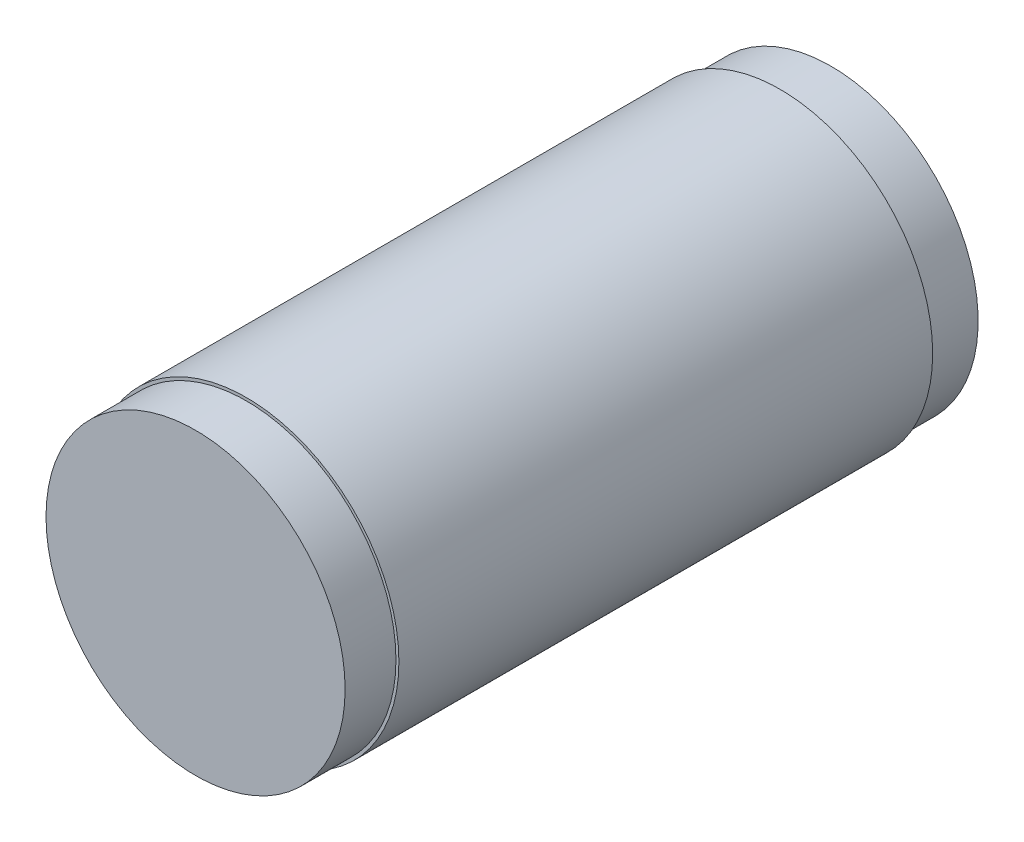
ISO-10303-21;
HEADER;
FILE_DESCRIPTION(('STEP AP214'),'2;1');
FILE_NAME('part.step','',(''),(''),'','','');
FILE_SCHEMA(('AUTOMOTIVE_DESIGN { 1 0 10303 214 1 1 1 1 }'));
ENDSEC;
DATA;
#1=APPLICATION_CONTEXT('core data for automotive mechanical design processes');
#2=APPLICATION_PROTOCOL_DEFINITION('international standard','automotive_design',2000,#1);
#3=PRODUCT_CONTEXT('',#1,'mechanical');
#4=PRODUCT('Part','Part','',(#3));
#5=PRODUCT_RELATED_PRODUCT_CATEGORY('part','',(#4));
#6=PRODUCT_DEFINITION_FORMATION('','',#4);
#7=PRODUCT_DEFINITION_CONTEXT('part definition',#1,'design');
#8=PRODUCT_DEFINITION('design','',#6,#7);
#9=PRODUCT_DEFINITION_SHAPE('','',#8);
#10=(LENGTH_UNIT() NAMED_UNIT(*) SI_UNIT(.MILLI.,.METRE.));
#11=(NAMED_UNIT(*) PLANE_ANGLE_UNIT() SI_UNIT($,.RADIAN.));
#12=(NAMED_UNIT(*) SI_UNIT($,.STERADIAN.) SOLID_ANGLE_UNIT());
#13=UNCERTAINTY_MEASURE_WITH_UNIT(LENGTH_MEASURE(1.E-05),#10,'distance_accuracy_value','');
#14=(GEOMETRIC_REPRESENTATION_CONTEXT(3) GLOBAL_UNCERTAINTY_ASSIGNED_CONTEXT((#13)) GLOBAL_UNIT_ASSIGNED_CONTEXT((#10,
#11,#12)) REPRESENTATION_CONTEXT('',''));
#15=CARTESIAN_POINT('',(0.,0.,0.));
#16=DIRECTION('',(0.,0.,1.));
#17=DIRECTION('',(1.,0.,0.));
#18=AXIS2_PLACEMENT_3D('',#15,#16,#17);
#19=CARTESIAN_POINT('',(0.,0.,125.));
#20=DIRECTION('',(0.,0.,-1.));
#21=DIRECTION('',(-1.,0.,0.));
#22=AXIS2_PLACEMENT_3D('',#19,#20,#21);
#23=CYLINDRICAL_SURFACE('',#22,30.);
#24=CARTESIAN_POINT('',(0.,0.,10.));
#25=DIRECTION('',(0.,0.,-1.));
#26=DIRECTION('',(-1.,0.,0.));
#27=AXIS2_PLACEMENT_3D('',#24,#25,#26);
#28=CIRCLE('',#27,30.);
#29=CARTESIAN_POINT('',(-30.,0.,10.));
#30=VERTEX_POINT('',#29);
#31=EDGE_CURVE('E55',#30,#30,#28,.T.);
#32=ORIENTED_EDGE('',*,*,#31,.F.);
#33=EDGE_LOOP('',(#32));
#34=FACE_BOUND('',#33,.T.);
#35=CARTESIAN_POINT('',(0.,0.,115.));
#36=DIRECTION('',(0.,0.,1.));
#37=DIRECTION('',(1.,0.,0.));
#38=AXIS2_PLACEMENT_3D('',#35,#36,#37);
#39=CIRCLE('',#38,30.);
#40=CARTESIAN_POINT('',(30.,0.,115.));
#41=VERTEX_POINT('',#40);
#42=EDGE_CURVE('E62',#41,#41,#39,.T.);
#43=ORIENTED_EDGE('',*,*,#42,.F.);
#44=EDGE_LOOP('',(#43));
#45=FACE_BOUND('',#44,.T.);
#46=ADVANCED_FACE('F36',(#34,#45),#23,.T.);
#47=CARTESIAN_POINT('',(0.,0.,0.));
#48=DIRECTION('',(0.,0.,1.));
#49=DIRECTION('',(1.,0.,0.));
#50=AXIS2_PLACEMENT_3D('',#47,#48,#49);
#51=PLANE('',#50);
#52=CARTESIAN_POINT('',(0.,0.,0.));
#53=DIRECTION('',(0.,0.,1.));
#54=DIRECTION('',(1.,0.,0.));
#55=AXIS2_PLACEMENT_3D('',#52,#53,#54);
#56=CIRCLE('',#55,21.1);
#57=CARTESIAN_POINT('',(21.1,0.,0.));
#58=VERTEX_POINT('',#57);
#59=EDGE_CURVE('E46',#58,#58,#56,.T.);
#60=ORIENTED_EDGE('',*,*,#59,.T.);
#61=EDGE_LOOP('',(#60));
#62=FACE_BOUND('',#61,.T.);
#63=CARTESIAN_POINT('',(0.,0.,0.));
#64=DIRECTION('',(0.,0.,-1.));
#65=DIRECTION('',(-1.,0.,0.));
#66=AXIS2_PLACEMENT_3D('',#63,#64,#65);
#67=CIRCLE('',#66,28.9459801007032);
#68=CARTESIAN_POINT('',(-28.9459801007032,0.,0.));
#69=VERTEX_POINT('',#68);
#70=EDGE_CURVE('E59',#69,#69,#67,.T.);
#71=ORIENTED_EDGE('',*,*,#70,.T.);
#72=EDGE_LOOP('',(#71));
#73=FACE_BOUND('',#72,.T.);
#74=ADVANCED_FACE('F85',(#62,#73),#51,.F.);
#75=CARTESIAN_POINT('',(0.,0.,125.));
#76=DIRECTION('',(0.,0.,-1.));
#77=DIRECTION('',(-1.,0.,0.));
#78=AXIS2_PLACEMENT_3D('',#75,#76,#77);
#79=CYLINDRICAL_SURFACE('',#78,25.);
#80=CARTESIAN_POINT('',(0.,0.,9.99999999999999));
#81=DIRECTION('',(0.,0.,1.));
#82=DIRECTION('',(1.,0.,0.));
#83=AXIS2_PLACEMENT_3D('',#80,#81,#82);
#84=CIRCLE('',#83,25.);
#85=CARTESIAN_POINT('',(25.,0.,9.99999999999999));
#86=VERTEX_POINT('',#85);
#87=EDGE_CURVE('E10',#86,#86,#84,.T.);
#88=ORIENTED_EDGE('',*,*,#87,.F.);
#89=EDGE_LOOP('',(#88));
#90=FACE_BOUND('',#89,.T.);
#91=CARTESIAN_POINT('',(0.,0.,115.));
#92=DIRECTION('',(0.,0.,1.));
#93=DIRECTION('',(1.,0.,0.));
#94=AXIS2_PLACEMENT_3D('',#91,#92,#93);
#95=CIRCLE('',#94,25.);
#96=CARTESIAN_POINT('',(25.,0.,115.));
#97=VERTEX_POINT('',#96);
#98=EDGE_CURVE('E51',#97,#97,#95,.T.);
#99=ORIENTED_EDGE('',*,*,#98,.T.);
#100=EDGE_LOOP('',(#99));
#101=FACE_BOUND('',#100,.T.);
#102=ADVANCED_FACE('F90',(#90,#101),#79,.F.);
#103=CARTESIAN_POINT('',(0.,0.,10.));
#104=DIRECTION('',(0.,0.,1.));
#105=DIRECTION('',(1.,0.,0.));
#106=AXIS2_PLACEMENT_3D('',#103,#104,#105);
#107=PLANE('',#106);
#108=ORIENTED_EDGE('',*,*,#87,.T.);
#109=EDGE_LOOP('',(#108));
#110=FACE_BOUND('',#109,.T.);
#111=CARTESIAN_POINT('',(0.,0.,10.));
#112=DIRECTION('',(0.,0.,1.));
#113=DIRECTION('',(1.,0.,0.));
#114=AXIS2_PLACEMENT_3D('',#111,#112,#113);
#115=CIRCLE('',#114,21.1);
#116=CARTESIAN_POINT('',(21.1,0.,10.));
#117=VERTEX_POINT('',#116);
#118=EDGE_CURVE('E42',#117,#117,#115,.T.);
#119=ORIENTED_EDGE('',*,*,#118,.F.);
#120=EDGE_LOOP('',(#119));
#121=FACE_BOUND('',#120,.T.);
#122=ADVANCED_FACE('F112',(#110,#121),#107,.T.);
#123=CARTESIAN_POINT('',(0.,0.,10.));
#124=DIRECTION('',(0.,0.,-1.));
#125=DIRECTION('',(-1.,0.,0.));
#126=AXIS2_PLACEMENT_3D('',#123,#124,#125);
#127=CYLINDRICAL_SURFACE('',#126,21.1);
#128=ORIENTED_EDGE('',*,*,#118,.T.);
#129=EDGE_LOOP('',(#128));
#130=FACE_BOUND('',#129,.T.);
#131=ORIENTED_EDGE('',*,*,#59,.F.);
#132=EDGE_LOOP('',(#131));
#133=FACE_BOUND('',#132,.T.);
#134=ADVANCED_FACE('F105',(#130,#133),#127,.F.);
#135=CARTESIAN_POINT('',(0.,0.,115.));
#136=DIRECTION('',(0.,0.,1.));
#137=DIRECTION('',(1.,0.,0.));
#138=AXIS2_PLACEMENT_3D('',#135,#136,#137);
#139=PLANE('',#138);
#140=ORIENTED_EDGE('',*,*,#98,.F.);
#141=EDGE_LOOP('',(#140));
#142=FACE_BOUND('',#141,.T.);
#143=ADVANCED_FACE('F96',(#142),#139,.F.);
#144=CARTESIAN_POINT('',(0.,0.,10.));
#145=DIRECTION('',(0.,0.,-1.));
#146=DIRECTION('',(-1.,0.,0.));
#147=AXIS2_PLACEMENT_3D('',#144,#145,#146);
#148=PLANE('',#147);
#149=CARTESIAN_POINT('',(0.,0.,10.));
#150=DIRECTION('',(0.,0.,-1.));
#151=DIRECTION('',(-1.,0.,0.));
#152=AXIS2_PLACEMENT_3D('',#149,#150,#151);
#153=CIRCLE('',#152,28.9459801007032);
#154=CARTESIAN_POINT('',(-28.9459801007032,0.,10.));
#155=VERTEX_POINT('',#154);
#156=EDGE_CURVE('E58',#155,#155,#153,.T.);
#157=ORIENTED_EDGE('',*,*,#156,.F.);
#158=EDGE_LOOP('',(#157));
#159=FACE_BOUND('',#158,.T.);
#160=ORIENTED_EDGE('',*,*,#31,.T.);
#161=EDGE_LOOP('',(#160));
#162=FACE_BOUND('',#161,.T.);
#163=ADVANCED_FACE('F94',(#159,#162),#148,.T.);
#164=CARTESIAN_POINT('',(0.,0.,10.));
#165=DIRECTION('',(0.,0.,-1.));
#166=DIRECTION('',(-1.,0.,0.));
#167=AXIS2_PLACEMENT_3D('',#164,#165,#166);
#168=CYLINDRICAL_SURFACE('',#167,28.9459801007032);
#169=ORIENTED_EDGE('',*,*,#156,.T.);
#170=EDGE_LOOP('',(#169));
#171=FACE_BOUND('',#170,.T.);
#172=ORIENTED_EDGE('',*,*,#70,.F.);
#173=EDGE_LOOP('',(#172));
#174=FACE_BOUND('',#173,.T.);
#175=ADVANCED_FACE('F80',(#171,#174),#168,.T.);
#176=CARTESIAN_POINT('',(0.,0.,115.));
#177=DIRECTION('',(0.,0.,1.));
#178=DIRECTION('',(1.,0.,0.));
#179=AXIS2_PLACEMENT_3D('',#176,#177,#178);
#180=PLANE('',#179);
#181=CARTESIAN_POINT('',(0.,0.,115.));
#182=DIRECTION('',(0.,0.,1.));
#183=DIRECTION('',(1.,0.,0.));
#184=AXIS2_PLACEMENT_3D('',#181,#182,#183);
#185=CIRCLE('',#184,29.4209543631188);
#186=CARTESIAN_POINT('',(29.4209543631188,0.,115.));
#187=VERTEX_POINT('',#186);
#188=EDGE_CURVE('E67',#187,#187,#185,.T.);
#189=ORIENTED_EDGE('',*,*,#188,.F.);
#190=EDGE_LOOP('',(#189));
#191=FACE_BOUND('',#190,.T.);
#192=ORIENTED_EDGE('',*,*,#42,.T.);
#193=EDGE_LOOP('',(#192));
#194=FACE_BOUND('',#193,.T.);
#195=ADVANCED_FACE('F77',(#191,#194),#180,.T.);
#196=CARTESIAN_POINT('',(0.,0.,115.));
#197=DIRECTION('',(0.,0.,1.));
#198=DIRECTION('',(1.,0.,0.));
#199=AXIS2_PLACEMENT_3D('',#196,#197,#198);
#200=CYLINDRICAL_SURFACE('',#199,29.4209543631188);
#201=ORIENTED_EDGE('',*,*,#188,.T.);
#202=EDGE_LOOP('',(#201));
#203=FACE_BOUND('',#202,.T.);
#204=CARTESIAN_POINT('',(0.,0.,125.));
#205=DIRECTION('',(0.,0.,1.));
#206=DIRECTION('',(1.,0.,0.));
#207=AXIS2_PLACEMENT_3D('',#204,#205,#206);
#208=CIRCLE('',#207,29.4209543631188);
#209=CARTESIAN_POINT('',(29.4209543631188,0.,125.));
#210=VERTEX_POINT('',#209);
#211=EDGE_CURVE('E68',#210,#210,#208,.T.);
#212=ORIENTED_EDGE('',*,*,#211,.F.);
#213=EDGE_LOOP('',(#212));
#214=FACE_BOUND('',#213,.T.);
#215=ADVANCED_FACE('F74',(#203,#214),#200,.T.);
#216=CARTESIAN_POINT('',(0.,0.,125.));
#217=DIRECTION('',(0.,0.,1.));
#218=DIRECTION('',(1.,0.,0.));
#219=AXIS2_PLACEMENT_3D('',#216,#217,#218);
#220=PLANE('',#219);
#221=ORIENTED_EDGE('',*,*,#211,.T.);
#222=EDGE_LOOP('',(#221));
#223=FACE_BOUND('',#222,.T.);
#224=ADVANCED_FACE('F118',(#223),#220,.T.);
#225=CLOSED_SHELL('',(#46,#74,#102,#122,#134,#143,#163,#175,#195,#215,#224));
#226=MANIFOLD_SOLID_BREP('B2',#225);
#227=ADVANCED_BREP_SHAPE_REPRESENTATION('',(#18,#226),#14);
#228=SHAPE_DEFINITION_REPRESENTATION(#9,#227);
ENDSEC;
END-ISO-10303-21;
